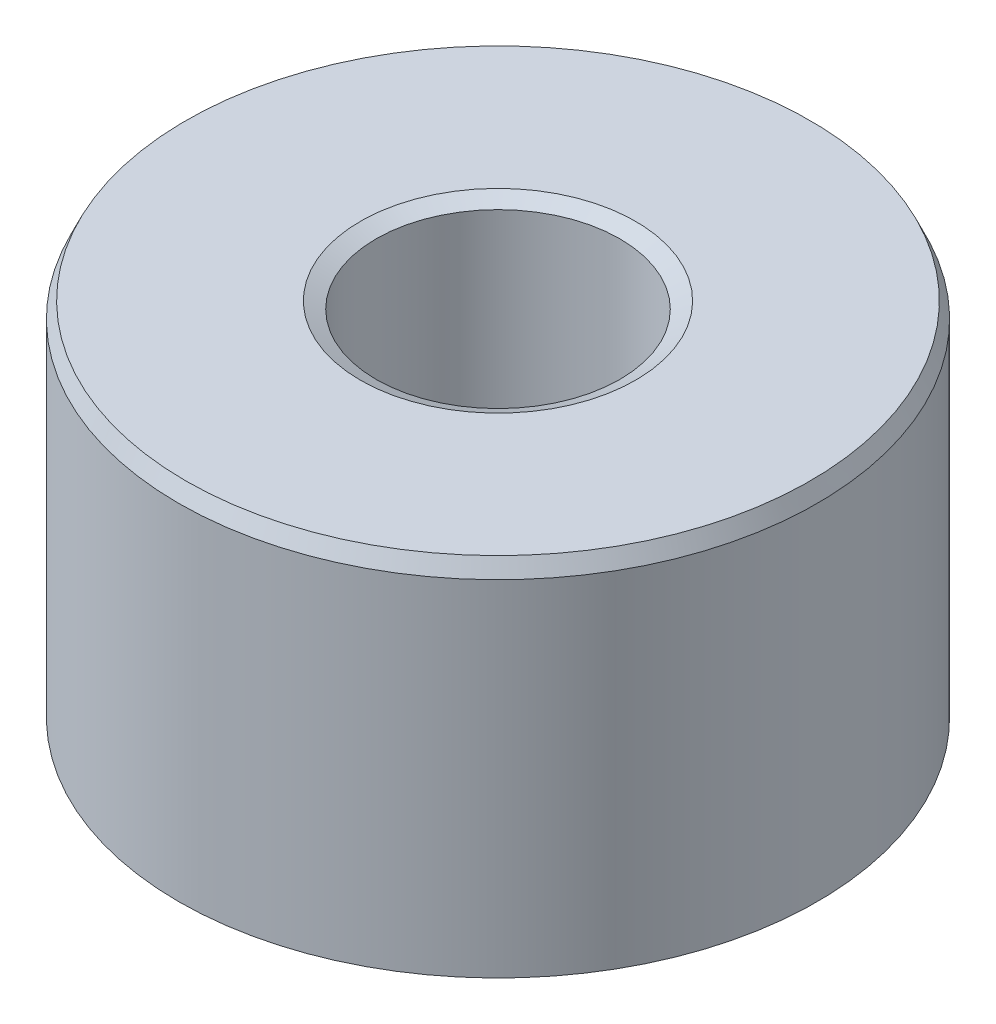
ISO-10303-21;
HEADER;
FILE_DESCRIPTION(('STEP AP214'),'2;1');
FILE_NAME('part.step','',(''),(''),'','','');
FILE_SCHEMA(('AUTOMOTIVE_DESIGN { 1 0 10303 214 1 1 1 1 }'));
ENDSEC;
DATA;
#1=APPLICATION_CONTEXT('core data for automotive mechanical design processes');
#2=APPLICATION_PROTOCOL_DEFINITION('international standard','automotive_design',2000,#1);
#3=PRODUCT_CONTEXT('',#1,'mechanical');
#4=PRODUCT('Part','Part','',(#3));
#5=PRODUCT_RELATED_PRODUCT_CATEGORY('part','',(#4));
#6=PRODUCT_DEFINITION_FORMATION('','',#4);
#7=PRODUCT_DEFINITION_CONTEXT('part definition',#1,'design');
#8=PRODUCT_DEFINITION('design','',#6,#7);
#9=PRODUCT_DEFINITION_SHAPE('','',#8);
#10=(LENGTH_UNIT() NAMED_UNIT(*) SI_UNIT(.MILLI.,.METRE.));
#11=(NAMED_UNIT(*) PLANE_ANGLE_UNIT() SI_UNIT($,.RADIAN.));
#12=(NAMED_UNIT(*) SI_UNIT($,.STERADIAN.) SOLID_ANGLE_UNIT());
#13=UNCERTAINTY_MEASURE_WITH_UNIT(LENGTH_MEASURE(1.E-05),#10,'distance_accuracy_value','');
#14=(GEOMETRIC_REPRESENTATION_CONTEXT(3) GLOBAL_UNCERTAINTY_ASSIGNED_CONTEXT((#13)) GLOBAL_UNIT_ASSIGNED_CONTEXT((#10,
#11,#12)) REPRESENTATION_CONTEXT('',''));
#15=CARTESIAN_POINT('',(0.,0.,0.));
#16=DIRECTION('',(0.,0.,1.));
#17=DIRECTION('',(1.,0.,0.));
#18=AXIS2_PLACEMENT_3D('',#15,#16,#17);
#19=CARTESIAN_POINT('',(0.,11.5216737406712,0.));
#20=DIRECTION('',(0.,-1.,0.));
#21=DIRECTION('',(0.,0.,-1.));
#22=AXIS2_PLACEMENT_3D('',#19,#20,#21);
#23=CYLINDRICAL_SURFACE('',#22,10.);
#24=CARTESIAN_POINT('',(0.,0.226137421515841,0.));
#25=DIRECTION('',(0.,1.,0.));
#26=DIRECTION('',(0.,0.,1.));
#27=AXIS2_PLACEMENT_3D('',#24,#25,#26);
#28=CIRCLE('',#27,10.);
#29=CARTESIAN_POINT('',(0.,0.226137421515841,10.));
#30=VERTEX_POINT('',#29);
#31=EDGE_CURVE('E10',#30,#30,#28,.T.);
#32=ORIENTED_EDGE('',*,*,#31,.T.);
#33=EDGE_LOOP('',(#32));
#34=FACE_BOUND('',#33,.T.);
#35=CARTESIAN_POINT('',(0.,11.0275866220737,0.));
#36=DIRECTION('',(0.,1.,0.));
#37=DIRECTION('',(0.,0.,1.));
#38=AXIS2_PLACEMENT_3D('',#35,#36,#37);
#39=CIRCLE('',#38,10.);
#40=CARTESIAN_POINT('',(0.,11.0275866220737,10.));
#41=VERTEX_POINT('',#40);
#42=EDGE_CURVE('E50',#41,#41,#39,.F.);
#43=ORIENTED_EDGE('',*,*,#42,.T.);
#44=EDGE_LOOP('',(#43));
#45=FACE_BOUND('',#44,.T.);
#46=ADVANCED_FACE('F39',(#34,#45),#23,.T.);
#47=CARTESIAN_POINT('',(0.,11.5216737406712,0.));
#48=DIRECTION('',(0.,1.,0.));
#49=DIRECTION('',(0.,0.,1.));
#50=AXIS2_PLACEMENT_3D('',#47,#48,#49);
#51=PLANE('',#50);
#52=CARTESIAN_POINT('',(0.,11.5216737406712,0.));
#53=DIRECTION('',(0.,1.,0.));
#54=DIRECTION('',(0.,0.,1.));
#55=AXIS2_PLACEMENT_3D('',#52,#53,#54);
#56=CIRCLE('',#55,4.3096974399621);
#57=CARTESIAN_POINT('',(0.,11.5216737406712,4.3096974399621));
#58=VERTEX_POINT('',#57);
#59=EDGE_CURVE('E58',#58,#58,#56,.F.);
#60=ORIENTED_EDGE('',*,*,#59,.T.);
#61=EDGE_LOOP('',(#60));
#62=FACE_BOUND('',#61,.T.);
#63=CARTESIAN_POINT('',(0.,11.5216737406712,0.));
#64=DIRECTION('',(0.,1.,0.));
#65=DIRECTION('',(0.,0.,1.));
#66=AXIS2_PLACEMENT_3D('',#63,#64,#65);
#67=CIRCLE('',#66,9.77386257848415);
#68=CARTESIAN_POINT('',(0.,11.5216737406712,9.77386257848415));
#69=VERTEX_POINT('',#68);
#70=EDGE_CURVE('E61',#69,#69,#67,.T.);
#71=ORIENTED_EDGE('',*,*,#70,.T.);
#72=EDGE_LOOP('',(#71));
#73=FACE_BOUND('',#72,.T.);
#74=ADVANCED_FACE('F88',(#62,#73),#51,.T.);
#75=CARTESIAN_POINT('',(0.,0.,0.));
#76=DIRECTION('',(0.,1.,0.));
#77=DIRECTION('',(0.,0.,1.));
#78=AXIS2_PLACEMENT_3D('',#75,#76,#77);
#79=PLANE('',#78);
#80=CARTESIAN_POINT('',(0.,0.,0.));
#81=DIRECTION('',(0.,1.,0.));
#82=DIRECTION('',(0.,0.,1.));
#83=AXIS2_PLACEMENT_3D('',#80,#81,#82);
#84=CIRCLE('',#83,4.04174774288045);
#85=CARTESIAN_POINT('',(0.,0.,4.04174774288045));
#86=VERTEX_POINT('',#85);
#87=EDGE_CURVE('E51',#86,#86,#84,.T.);
#88=ORIENTED_EDGE('',*,*,#87,.T.);
#89=EDGE_LOOP('',(#88));
#90=FACE_BOUND('',#89,.T.);
#91=CARTESIAN_POINT('',(0.,0.,0.));
#92=DIRECTION('',(0.,1.,0.));
#93=DIRECTION('',(0.,0.,1.));
#94=AXIS2_PLACEMENT_3D('',#91,#92,#93);
#95=CIRCLE('',#94,9.50591288140251);
#96=CARTESIAN_POINT('',(0.,0.,9.50591288140251));
#97=VERTEX_POINT('',#96);
#98=EDGE_CURVE('E54',#97,#97,#95,.F.);
#99=ORIENTED_EDGE('',*,*,#98,.T.);
#100=EDGE_LOOP('',(#99));
#101=FACE_BOUND('',#100,.T.);
#102=ADVANCED_FACE('F83',(#90,#101),#79,.F.);
#103=CARTESIAN_POINT('',(0.,11.5216737406712,0.));
#104=DIRECTION('',(0.,-1.,0.));
#105=DIRECTION('',(0.,0.,-1.));
#106=AXIS2_PLACEMENT_3D('',#103,#104,#105);
#107=CYLINDRICAL_SURFACE('',#106,3.81561032136461);
#108=CARTESIAN_POINT('',(0.,11.2955363191554,0.));
#109=DIRECTION('',(0.,1.,0.));
#110=DIRECTION('',(0.,0.,1.));
#111=AXIS2_PLACEMENT_3D('',#108,#109,#110);
#112=CIRCLE('',#111,3.81561032136461);
#113=CARTESIAN_POINT('',(0.,11.2955363191554,3.81561032136461));
#114=VERTEX_POINT('',#113);
#115=EDGE_CURVE('E67',#114,#114,#112,.T.);
#116=ORIENTED_EDGE('',*,*,#115,.T.);
#117=EDGE_LOOP('',(#116));
#118=FACE_BOUND('',#117,.T.);
#119=CARTESIAN_POINT('',(0.,0.494087118597494,0.));
#120=DIRECTION('',(0.,1.,0.));
#121=DIRECTION('',(0.,0.,1.));
#122=AXIS2_PLACEMENT_3D('',#119,#120,#121);
#123=CIRCLE('',#122,3.81561032136461);
#124=CARTESIAN_POINT('',(0.,0.494087118597494,3.81561032136461));
#125=VERTEX_POINT('',#124);
#126=EDGE_CURVE('E69',#125,#125,#123,.F.);
#127=ORIENTED_EDGE('',*,*,#126,.T.);
#128=EDGE_LOOP('',(#127));
#129=FACE_BOUND('',#128,.T.);
#130=ADVANCED_FACE('F71',(#118,#129),#107,.F.);
#131=CARTESIAN_POINT('',(0.,11.2955363191554,0.));
#132=DIRECTION('',(0.,1.,0.));
#133=DIRECTION('',(0.,0.,1.));
#134=AXIS2_PLACEMENT_3D('',#131,#132,#133);
#135=CONICAL_SURFACE('',#134,3.81561032136461,1.14156802230633);
#136=CARTESIAN_POINT('',(0.,11.5216737406712,4.3096974399621));
#137=CARTESIAN_POINT('',(0.,11.5193181425304,4.30455069914338));
#138=CARTESIAN_POINT('',(0.,11.5169625443896,4.29940395832465));
#139=CARTESIAN_POINT('',(0.,11.5122513481081,4.28911047668721));
#140=CARTESIAN_POINT('',(0.,11.5098957499673,4.28396373586848));
#141=CARTESIAN_POINT('',(0.,11.5051845536857,4.27367025423103));
#142=CARTESIAN_POINT('',(0.,11.5028289555449,4.26852351341231));
#143=CARTESIAN_POINT('',(0.,11.4981177592633,4.25823003177486));
#144=CARTESIAN_POINT('',(0.,11.4957621611225,4.25308329095614));
#145=CARTESIAN_POINT('',(0.,11.4910509648409,4.24278980931869));
#146=CARTESIAN_POINT('',(0.,11.4886953667002,4.23764306849997));
#147=CARTESIAN_POINT('',(0.,11.4839841704186,4.22734958686252));
#148=CARTESIAN_POINT('',(0.,11.4816285722778,4.22220284604379));
#149=CARTESIAN_POINT('',(0.,11.4769173759962,4.21190936440635));
#150=CARTESIAN_POINT('',(0.,11.4745617778554,4.20676262358762));
#151=CARTESIAN_POINT('',(0.,11.4698505815738,4.19646914195017));
#152=CARTESIAN_POINT('',(0.,11.467494983433,4.19132240113145));
#153=CARTESIAN_POINT('',(0.,11.4627837871515,4.181028919494));
#154=CARTESIAN_POINT('',(0.,11.4604281890107,4.17588217867528));
#155=CARTESIAN_POINT('',(0.,11.4557169927291,4.16558869703783));
#156=CARTESIAN_POINT('',(0.,11.4533613945883,4.16044195621911));
#157=CARTESIAN_POINT('',(0.,11.4486501983067,4.15014847458166));
#158=CARTESIAN_POINT('',(0.,11.4462946001659,4.14500173376294));
#159=CARTESIAN_POINT('',(0.,11.4415834038844,4.13470825212549));
#160=CARTESIAN_POINT('',(0.,11.4392278057436,4.12956151130676));
#161=CARTESIAN_POINT('',(0.,11.434516609462,4.11926802966932));
#162=CARTESIAN_POINT('',(0.,11.4321610113212,4.11412128885059));
#163=CARTESIAN_POINT('',(0.,11.4274498150396,4.10382780721314));
#164=CARTESIAN_POINT('',(0.,11.4250942168988,4.09868106639442));
#165=CARTESIAN_POINT('',(0.,11.4203830206172,4.08838758475697));
#166=CARTESIAN_POINT('',(0.,11.4180274224765,4.08324084393825));
#167=CARTESIAN_POINT('',(0.,11.4133162261949,4.0729473623008));
#168=CARTESIAN_POINT('',(0.,11.4109606280541,4.06780062148208));
#169=CARTESIAN_POINT('',(0.,11.4062494317725,4.05750713984463));
#170=CARTESIAN_POINT('',(0.,11.4038938336317,4.05236039902591));
#171=CARTESIAN_POINT('',(0.,11.3991826373501,4.04206691738846));
#172=CARTESIAN_POINT('',(0.,11.3968270392093,4.03692017656974));
#173=CARTESIAN_POINT('',(0.,11.3921158429278,4.02662669493229));
#174=CARTESIAN_POINT('',(0.,11.389760244787,4.02147995411356));
#175=CARTESIAN_POINT('',(0.,11.3850490485054,4.01118647247611));
#176=CARTESIAN_POINT('',(0.,11.3826934503646,4.00603973165739));
#177=CARTESIAN_POINT('',(0.,11.377982254083,3.99574625001994));
#178=CARTESIAN_POINT('',(0.,11.3756266559422,3.99059950920122));
#179=CARTESIAN_POINT('',(0.,11.3709154596607,3.98030602756377));
#180=CARTESIAN_POINT('',(0.,11.3685598615199,3.97515928674505));
#181=CARTESIAN_POINT('',(0.,11.3638486652383,3.9648658051076));
#182=CARTESIAN_POINT('',(0.,11.3614930670975,3.95971906428888));
#183=CARTESIAN_POINT('',(0.,11.3567818708159,3.94942558265143));
#184=CARTESIAN_POINT('',(0.,11.3544262726751,3.9442788418327));
#185=CARTESIAN_POINT('',(0.,11.3497150763935,3.93398536019526));
#186=CARTESIAN_POINT('',(0.,11.3473594782528,3.92883861937653));
#187=CARTESIAN_POINT('',(0.,11.3426482819712,3.91854513773908));
#188=CARTESIAN_POINT('',(0.,11.3402926838304,3.91339839692036));
#189=CARTESIAN_POINT('',(0.,11.3355814875488,3.90310491528291));
#190=CARTESIAN_POINT('',(0.,11.333225889408,3.89795817446419));
#191=CARTESIAN_POINT('',(0.,11.3285146931264,3.88766469282674));
#192=CARTESIAN_POINT('',(0.,11.3261590949856,3.88251795200802));
#193=CARTESIAN_POINT('',(0.,11.3214478987041,3.87222447037057));
#194=CARTESIAN_POINT('',(0.,11.3190923005633,3.86707772955185));
#195=CARTESIAN_POINT('',(0.,11.3143811042817,3.8567842479144));
#196=CARTESIAN_POINT('',(0.,11.3120255061409,3.85163750709567));
#197=CARTESIAN_POINT('',(0.,11.3073143098593,3.84134402545823));
#198=CARTESIAN_POINT('',(0.,11.3049587117185,3.8361972846395));
#199=CARTESIAN_POINT('',(0.,11.300247515437,3.82590380300205));
#200=CARTESIAN_POINT('',(0.,11.2978919172962,3.82075706218333));
#201=CARTESIAN_POINT('',(0.,11.2955363191554,3.81561032136461));
#202=B_SPLINE_CURVE_WITH_KNOTS('',3,(#136,#137,#138,#139,#140,#141,#142,#143,#144,#145,#146,
#147,#148,#149,#150,#151,#152,#153,#154,#155,#156,#157,#158,#159,#160,#161,#162,#163,#164,#165,
#166,#167,#168,#169,#170,#171,#172,#173,#174,#175,#176,#177,#178,#179,#180,#181,#182,#183,#184,
#185,#186,#187,#188,#189,#190,#191,#192,#193,#194,#195,#196,#197,#198,#199,#200,#201),
.UNSPECIFIED.,.F.,.F.,(4,2,2,2,2,2,2,2,2,2,2,2,2,2,2,2,2,2,2,2,2,2,2,2,2,2,2,2,2,2,2,2,4),(0.,
0.0169805786975631,0.0339611573951255,0.0509417360926879,0.0679223147902503,0.0849028934878127,
0.101883472185374,0.118864050882937,0.135844629580499,0.152825208278062,0.169805786975624,
0.186786365673186,0.203766944370749,0.220747523068311,0.237728101765874,0.254708680463435,
0.271689259160998,0.288669837858561,0.305650416556123,0.322630995253686,0.339611573951248,
0.35659215264881,0.373572731346373,0.390553310043935,0.407533888741498,0.424514467439059,
0.441495046136622,0.458475624834184,0.475456203531746,0.492436782229309,0.509417360926871,
0.526397939624434,0.543378518321996),.UNSPECIFIED.);
#203=EDGE_CURVE('BSEAM77',#58,#114,#202,.T.);
#204=ORIENTED_EDGE('',*,*,#59,.F.);
#205=ORIENTED_EDGE('',*,*,#115,.F.);
#206=ORIENTED_EDGE('',*,*,#203,.T.);
#207=ORIENTED_EDGE('',*,*,#203,.F.);
#208=EDGE_LOOP('',(#204,#206,#205,#207));
#209=FACE_BOUND('',#208,.T.);
#210=ADVANCED_FACE('F77',(#209),#135,.F.);
#211=CARTESIAN_POINT('',(0.,0.,0.));
#212=DIRECTION('',(0.,-1.,0.));
#213=DIRECTION('',(0.,0.,-1.));
#214=AXIS2_PLACEMENT_3D('',#211,#212,#213);
#215=CONICAL_SURFACE('',#214,4.04174774288045,0.429228304488563);
#216=ORIENTED_EDGE('',*,*,#126,.F.);
#217=EDGE_LOOP('',(#216));
#218=FACE_BOUND('',#217,.T.);
#219=ORIENTED_EDGE('',*,*,#87,.F.);
#220=EDGE_LOOP('',(#219));
#221=FACE_BOUND('',#220,.T.);
#222=ADVANCED_FACE('F73',(#218,#221),#215,.F.);
#223=CARTESIAN_POINT('',(0.,0.226137421515841,0.));
#224=DIRECTION('',(0.,1.,0.));
#225=DIRECTION('',(0.,0.,1.));
#226=AXIS2_PLACEMENT_3D('',#223,#224,#225);
#227=CONICAL_SURFACE('',#226,10.,1.14156802230633);
#228=CARTESIAN_POINT('',(0.,0.,9.50591288140251));
#229=CARTESIAN_POINT('',(0.,0.00235559814078998,9.51105962222123));
#230=CARTESIAN_POINT('',(0.,0.00471119628157999,9.51620636303996));
#231=CARTESIAN_POINT('',(0.,0.00942239256316001,9.5264998446774));
#232=CARTESIAN_POINT('',(0.,0.01177799070395,9.53164658549613));
#233=CARTESIAN_POINT('',(0.,0.01648918698553,9.54194006713358));
#234=CARTESIAN_POINT('',(0.,0.01884478512632,9.5470868079523));
#235=CARTESIAN_POINT('',(0.,0.0235559814079001,9.55738028958975));
#236=CARTESIAN_POINT('',(0.,0.0259115795486901,9.56252703040847));
#237=CARTESIAN_POINT('',(0.,0.0306227758302701,9.57282051204592));
#238=CARTESIAN_POINT('',(0.,0.0329783739710601,9.57796725286464));
#239=CARTESIAN_POINT('',(0.,0.0376895702526401,9.58826073450209));
#240=CARTESIAN_POINT('',(0.,0.04004516839343,9.59340747532082));
#241=CARTESIAN_POINT('',(0.,0.0447563646750101,9.60370095695826));
#242=CARTESIAN_POINT('',(0.,0.0471119628158002,9.60884769777699));
#243=CARTESIAN_POINT('',(0.,0.0518231590973803,9.61914117941443));
#244=CARTESIAN_POINT('',(0.,0.0541787572381702,9.62428792023316));
#245=CARTESIAN_POINT('',(0.,0.0588899535197502,9.63458140187061));
#246=CARTESIAN_POINT('',(0.,0.0612455516605402,9.63972814268933));
#247=CARTESIAN_POINT('',(0.,0.0659567479421202,9.65002162432678));
#248=CARTESIAN_POINT('',(0.,0.0683123460829102,9.6551683651455));
#249=CARTESIAN_POINT('',(0.,0.0730235423644902,9.66546184678295));
#250=CARTESIAN_POINT('',(0.,0.0753791405052802,9.67060858760167));
#251=CARTESIAN_POINT('',(0.,0.0800903367868603,9.68090206923912));
#252=CARTESIAN_POINT('',(0.,0.0824459349276503,9.68604881005784));
#253=CARTESIAN_POINT('',(0.,0.0871571312092303,9.69634229169529));
#254=CARTESIAN_POINT('',(0.,0.0895127293500203,9.70148903251402));
#255=CARTESIAN_POINT('',(0.,0.0942239256316004,9.71178251415146));
#256=CARTESIAN_POINT('',(0.,0.0965795237723904,9.71692925497019));
#257=CARTESIAN_POINT('',(0.,0.10129072005397,9.72722273660763));
#258=CARTESIAN_POINT('',(0.,0.10364631819476,9.73236947742636));
#259=CARTESIAN_POINT('',(0.,0.10835751447634,9.74266295906381));
#260=CARTESIAN_POINT('',(0.,0.11071311261713,9.74780969988253));
#261=CARTESIAN_POINT('',(0.,0.11542430889871,9.75810318151998));
#262=CARTESIAN_POINT('',(0.,0.1177799070395,9.7632499223387));
#263=CARTESIAN_POINT('',(0.,0.12249110332108,9.77354340397615));
#264=CARTESIAN_POINT('',(0.,0.12484670146187,9.77869014479488));
#265=CARTESIAN_POINT('',(0.,0.129557897743451,9.78898362643232));
#266=CARTESIAN_POINT('',(0.,0.13191349588424,9.79413036725105));
#267=CARTESIAN_POINT('',(0.,0.136624692165821,9.80442384888849));
#268=CARTESIAN_POINT('',(0.,0.138980290306611,9.80957058970722));
#269=CARTESIAN_POINT('',(0.,0.143691486588191,9.81986407134467));
#270=CARTESIAN_POINT('',(0.,0.146047084728981,9.82501081216339));
#271=CARTESIAN_POINT('',(0.,0.150758281010561,9.83530429380084));
#272=CARTESIAN_POINT('',(0.,0.153113879151351,9.84045103461956));
#273=CARTESIAN_POINT('',(0.,0.157825075432931,9.85074451625701));
#274=CARTESIAN_POINT('',(0.,0.16018067357372,9.85589125707573));
#275=CARTESIAN_POINT('',(0.,0.164891869855301,9.86618473871318));
#276=CARTESIAN_POINT('',(0.,0.167247467996091,9.8713314795319));
#277=CARTESIAN_POINT('',(0.,0.171958664277671,9.88162496116935));
#278=CARTESIAN_POINT('',(0.,0.174314262418461,9.88677170198808));
#279=CARTESIAN_POINT('',(0.,0.179025458700041,9.89706518362552));
#280=CARTESIAN_POINT('',(0.,0.181381056840831,9.90221192444425));
#281=CARTESIAN_POINT('',(0.,0.186092253122411,9.91250540608169));
#282=CARTESIAN_POINT('',(0.,0.188447851263201,9.91765214690042));
#283=CARTESIAN_POINT('',(0.,0.193159047544781,9.92794562853787));
#284=CARTESIAN_POINT('',(0.,0.195514645685571,9.93309236935659));
#285=CARTESIAN_POINT('',(0.,0.200225841967151,9.94338585099404));
#286=CARTESIAN_POINT('',(0.,0.202581440107941,9.94853259181276));
#287=CARTESIAN_POINT('',(0.,0.207292636389521,9.95882607345021));
#288=CARTESIAN_POINT('',(0.,0.209648234530311,9.96397281426893));
#289=CARTESIAN_POINT('',(0.,0.214359430811891,9.97426629590638));
#290=CARTESIAN_POINT('',(0.,0.216715028952681,9.97941303672511));
#291=CARTESIAN_POINT('',(0.,0.221426225234261,9.98970651836255));
#292=CARTESIAN_POINT('',(0.,0.223781823375051,9.99485325918128));
#293=CARTESIAN_POINT('',(0.,0.226137421515841,10.));
#294=B_SPLINE_CURVE_WITH_KNOTS('',3,(#228,#229,#230,#231,#232,#233,#234,#235,#236,#237,#238,
#239,#240,#241,#242,#243,#244,#245,#246,#247,#248,#249,#250,#251,#252,#253,#254,#255,#256,#257,
#258,#259,#260,#261,#262,#263,#264,#265,#266,#267,#268,#269,#270,#271,#272,#273,#274,#275,#276,
#277,#278,#279,#280,#281,#282,#283,#284,#285,#286,#287,#288,#289,#290,#291,#292,#293),
.UNSPECIFIED.,.F.,.F.,(4,2,2,2,2,2,2,2,2,2,2,2,2,2,2,2,2,2,2,2,2,2,2,2,2,2,2,2,2,2,2,2,4),(0.,
0.0169805786975624,0.0339611573951249,0.0509417360926873,0.0679223147902498,0.0849028934878122,
0.101883472185375,0.118864050882936,0.135844629580498,0.15282520827806,0.169805786975623,
0.186786365673185,0.203766944370748,0.22074752306831,0.237728101765873,0.254708680463435,
0.271689259160998,0.28866983785856,0.305650416556123,0.322630995253685,0.339611573951248,
0.35659215264881,0.373572731346372,0.390553310043935,0.407533888741496,0.424514467439058,
0.441495046136621,0.458475624834183,0.475456203531746,0.492436782229308,0.509417360926871,
0.526397939624433,0.543378518321995),.UNSPECIFIED.);
#295=EDGE_CURVE('BSEAM76',#97,#30,#294,.T.);
#296=ORIENTED_EDGE('',*,*,#98,.F.);
#297=ORIENTED_EDGE('',*,*,#31,.F.);
#298=ORIENTED_EDGE('',*,*,#295,.T.);
#299=ORIENTED_EDGE('',*,*,#295,.F.);
#300=EDGE_LOOP('',(#296,#298,#297,#299));
#301=FACE_BOUND('',#300,.T.);
#302=ADVANCED_FACE('F76',(#301),#227,.T.);
#303=CARTESIAN_POINT('',(0.,11.5216737406712,0.));
#304=DIRECTION('',(0.,-1.,0.));
#305=DIRECTION('',(0.,0.,-1.));
#306=AXIS2_PLACEMENT_3D('',#303,#304,#305);
#307=CONICAL_SURFACE('',#306,9.77386257848415,0.429228304488566);
#308=ORIENTED_EDGE('',*,*,#42,.F.);
#309=EDGE_LOOP('',(#308));
#310=FACE_BOUND('',#309,.T.);
#311=ORIENTED_EDGE('',*,*,#70,.F.);
#312=EDGE_LOOP('',(#311));
#313=FACE_BOUND('',#312,.T.);
#314=ADVANCED_FACE('F45',(#310,#313),#307,.T.);
#315=CLOSED_SHELL('',(#46,#74,#102,#130,#210,#222,#302,#314));
#316=MANIFOLD_SOLID_BREP('B2',#315);
#317=ADVANCED_BREP_SHAPE_REPRESENTATION('',(#18,#316),#14);
#318=SHAPE_DEFINITION_REPRESENTATION(#9,#317);
ENDSEC;
END-ISO-10303-21;
